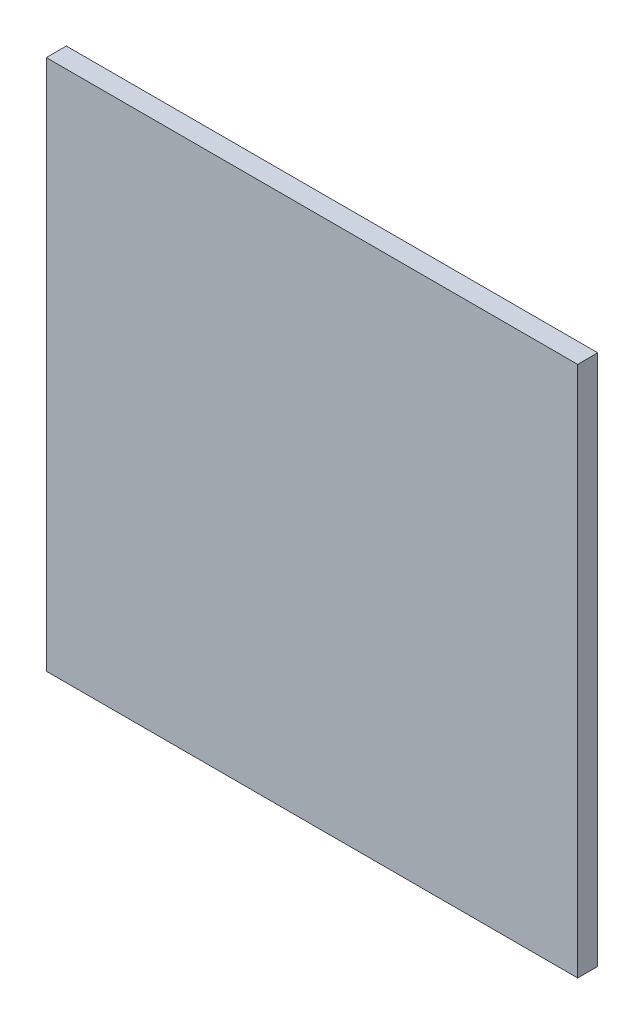
ISO-10303-21;
HEADER;
FILE_DESCRIPTION(('STEP AP214'),'2;1');
FILE_NAME('part.step','',(''),(''),'','','');
FILE_SCHEMA(('AUTOMOTIVE_DESIGN { 1 0 10303 214 1 1 1 1 }'));
ENDSEC;
DATA;
#1=APPLICATION_CONTEXT('core data for automotive mechanical design processes');
#2=APPLICATION_PROTOCOL_DEFINITION('international standard','automotive_design',2000,#1);
#3=PRODUCT_CONTEXT('',#1,'mechanical');
#4=PRODUCT('Part','Part','',(#3));
#5=PRODUCT_RELATED_PRODUCT_CATEGORY('part','',(#4));
#6=PRODUCT_DEFINITION_FORMATION('','',#4);
#7=PRODUCT_DEFINITION_CONTEXT('part definition',#1,'design');
#8=PRODUCT_DEFINITION('design','',#6,#7);
#9=PRODUCT_DEFINITION_SHAPE('','',#8);
#10=(LENGTH_UNIT() NAMED_UNIT(*) SI_UNIT(.MILLI.,.METRE.));
#11=(NAMED_UNIT(*) PLANE_ANGLE_UNIT() SI_UNIT($,.RADIAN.));
#12=(NAMED_UNIT(*) SI_UNIT($,.STERADIAN.) SOLID_ANGLE_UNIT());
#13=UNCERTAINTY_MEASURE_WITH_UNIT(LENGTH_MEASURE(1.E-05),#10,'distance_accuracy_value','');
#14=(GEOMETRIC_REPRESENTATION_CONTEXT(3) GLOBAL_UNCERTAINTY_ASSIGNED_CONTEXT((#13)) GLOBAL_UNIT_ASSIGNED_CONTEXT((#10,
#11,#12)) REPRESENTATION_CONTEXT('',''));
#15=CARTESIAN_POINT('',(0.,0.,0.));
#16=DIRECTION('',(0.,0.,1.));
#17=DIRECTION('',(1.,0.,0.));
#18=AXIS2_PLACEMENT_3D('',#15,#16,#17);
#19=CARTESIAN_POINT('',(-265.,265.,20.));
#20=DIRECTION('',(1.,0.,0.));
#21=DIRECTION('',(0.,1.,0.));
#22=AXIS2_PLACEMENT_3D('',#19,#20,#21);
#23=PLANE('',#22);
#24=DIRECTION('',(0.,-1.,0.));
#25=VECTOR('',#24,1.);
#26=CARTESIAN_POINT('',(-265.,265.,0.));
#27=LINE('',#26,#25);
#28=CARTESIAN_POINT('',(-265.,265.,0.));
#29=VERTEX_POINT('',#28);
#30=CARTESIAN_POINT('',(-265.,-265.,0.));
#31=VERTEX_POINT('',#30);
#32=EDGE_CURVE('E107',#29,#31,#27,.T.);
#33=ORIENTED_EDGE('',*,*,#32,.T.);
#34=DIRECTION('',(0.,0.,-1.));
#35=VECTOR('',#34,1.);
#36=CARTESIAN_POINT('',(-265.,-265.,20.));
#37=LINE('',#36,#35);
#38=CARTESIAN_POINT('',(-265.,-265.,20.));
#39=VERTEX_POINT('',#38);
#40=EDGE_CURVE('E11',#39,#31,#37,.T.);
#41=ORIENTED_EDGE('',*,*,#40,.F.);
#42=DIRECTION('',(0.,-1.,0.));
#43=VECTOR('',#42,1.);
#44=CARTESIAN_POINT('',(-265.,265.,20.));
#45=LINE('',#44,#43);
#46=CARTESIAN_POINT('',(-265.,265.,20.));
#47=VERTEX_POINT('',#46);
#48=EDGE_CURVE('E91',#47,#39,#45,.T.);
#49=ORIENTED_EDGE('',*,*,#48,.F.);
#50=DIRECTION('',(0.,0.,-1.));
#51=VECTOR('',#50,1.);
#52=CARTESIAN_POINT('',(-265.,265.,20.));
#53=LINE('',#52,#51);
#54=EDGE_CURVE('E103',#47,#29,#53,.T.);
#55=ORIENTED_EDGE('',*,*,#54,.T.);
#56=EDGE_LOOP('',(#33,#41,#49,#55));
#57=FACE_BOUND('',#56,.T.);
#58=ADVANCED_FACE('F39',(#57),#23,.F.);
#59=CARTESIAN_POINT('',(265.,-265.,20.));
#60=DIRECTION('',(0.,1.,0.));
#61=DIRECTION('',(-1.,0.,0.));
#62=AXIS2_PLACEMENT_3D('',#59,#60,#61);
#63=PLANE('',#62);
#64=DIRECTION('',(1.,0.,0.));
#65=VECTOR('',#64,1.);
#66=CARTESIAN_POINT('',(265.,-265.,0.));
#67=LINE('',#66,#65);
#68=CARTESIAN_POINT('',(265.,-265.,0.));
#69=VERTEX_POINT('',#68);
#70=EDGE_CURVE('E96',#31,#69,#67,.T.);
#71=ORIENTED_EDGE('',*,*,#70,.T.);
#72=DIRECTION('',(0.,0.,-1.));
#73=VECTOR('',#72,1.);
#74=CARTESIAN_POINT('',(265.,-265.,20.));
#75=LINE('',#74,#73);
#76=CARTESIAN_POINT('',(265.,-265.,20.));
#77=VERTEX_POINT('',#76);
#78=EDGE_CURVE('E48',#77,#69,#75,.T.);
#79=ORIENTED_EDGE('',*,*,#78,.F.);
#80=DIRECTION('',(1.,0.,0.));
#81=VECTOR('',#80,1.);
#82=CARTESIAN_POINT('',(265.,-265.,20.));
#83=LINE('',#82,#81);
#84=EDGE_CURVE('E86',#39,#77,#83,.T.);
#85=ORIENTED_EDGE('',*,*,#84,.F.);
#86=ORIENTED_EDGE('',*,*,#40,.T.);
#87=EDGE_LOOP('',(#71,#79,#85,#86));
#88=FACE_BOUND('',#87,.T.);
#89=ADVANCED_FACE('F95',(#88),#63,.F.);
#90=CARTESIAN_POINT('',(265.,265.,20.));
#91=DIRECTION('',(-1.,0.,0.));
#92=DIRECTION('',(0.,0.,1.));
#93=AXIS2_PLACEMENT_3D('',#90,#91,#92);
#94=PLANE('',#93);
#95=DIRECTION('',(0.,1.,0.));
#96=VECTOR('',#95,1.);
#97=CARTESIAN_POINT('',(265.,265.,0.));
#98=LINE('',#97,#96);
#99=CARTESIAN_POINT('',(265.,265.,0.));
#100=VERTEX_POINT('',#99);
#101=EDGE_CURVE('E73',#69,#100,#98,.T.);
#102=ORIENTED_EDGE('',*,*,#101,.T.);
#103=DIRECTION('',(0.,0.,-1.));
#104=VECTOR('',#103,1.);
#105=CARTESIAN_POINT('',(265.,265.,20.));
#106=LINE('',#105,#104);
#107=CARTESIAN_POINT('',(265.,265.,20.));
#108=VERTEX_POINT('',#107);
#109=EDGE_CURVE('E98',#108,#100,#106,.T.);
#110=ORIENTED_EDGE('',*,*,#109,.F.);
#111=DIRECTION('',(0.,1.,0.));
#112=VECTOR('',#111,1.);
#113=CARTESIAN_POINT('',(265.,265.,20.));
#114=LINE('',#113,#112);
#115=EDGE_CURVE('E89',#77,#108,#114,.T.);
#116=ORIENTED_EDGE('',*,*,#115,.F.);
#117=ORIENTED_EDGE('',*,*,#78,.T.);
#118=EDGE_LOOP('',(#102,#110,#116,#117));
#119=FACE_BOUND('',#118,.T.);
#120=ADVANCED_FACE('F99',(#119),#94,.F.);
#121=CARTESIAN_POINT('',(265.,265.,20.));
#122=DIRECTION('',(0.,-1.,0.));
#123=DIRECTION('',(1.,0.,0.));
#124=AXIS2_PLACEMENT_3D('',#121,#122,#123);
#125=PLANE('',#124);
#126=DIRECTION('',(-1.,0.,0.));
#127=VECTOR('',#126,1.);
#128=CARTESIAN_POINT('',(265.,265.,0.));
#129=LINE('',#128,#127);
#130=EDGE_CURVE('E79',#100,#29,#129,.T.);
#131=ORIENTED_EDGE('',*,*,#130,.T.);
#132=ORIENTED_EDGE('',*,*,#54,.F.);
#133=DIRECTION('',(-1.,0.,0.));
#134=VECTOR('',#133,1.);
#135=CARTESIAN_POINT('',(265.,265.,20.));
#136=LINE('',#135,#134);
#137=EDGE_CURVE('E56',#108,#47,#136,.T.);
#138=ORIENTED_EDGE('',*,*,#137,.F.);
#139=ORIENTED_EDGE('',*,*,#109,.T.);
#140=EDGE_LOOP('',(#131,#132,#138,#139));
#141=FACE_BOUND('',#140,.T.);
#142=ADVANCED_FACE('F120',(#141),#125,.F.);
#143=CARTESIAN_POINT('',(0.,0.,20.));
#144=DIRECTION('',(0.,0.,-1.));
#145=DIRECTION('',(-1.,0.,0.));
#146=AXIS2_PLACEMENT_3D('',#143,#144,#145);
#147=PLANE('',#146);
#148=ORIENTED_EDGE('',*,*,#48,.T.);
#149=ORIENTED_EDGE('',*,*,#84,.T.);
#150=ORIENTED_EDGE('',*,*,#115,.T.);
#151=ORIENTED_EDGE('',*,*,#137,.T.);
#152=EDGE_LOOP('',(#148,#149,#150,#151));
#153=FACE_BOUND('',#152,.T.);
#154=ADVANCED_FACE('F87',(#153),#147,.F.);
#155=CARTESIAN_POINT('',(0.,0.,0.));
#156=DIRECTION('',(0.,0.,-1.));
#157=DIRECTION('',(-1.,0.,0.));
#158=AXIS2_PLACEMENT_3D('',#155,#156,#157);
#159=PLANE('',#158);
#160=ORIENTED_EDGE('',*,*,#32,.F.);
#161=ORIENTED_EDGE('',*,*,#130,.F.);
#162=ORIENTED_EDGE('',*,*,#101,.F.);
#163=ORIENTED_EDGE('',*,*,#70,.F.);
#164=EDGE_LOOP('',(#160,#161,#162,#163));
#165=FACE_BOUND('',#164,.T.);
#166=ADVANCED_FACE('F123',(#165),#159,.T.);
#167=CLOSED_SHELL('',(#58,#89,#120,#142,#154,#166));
#168=MANIFOLD_SOLID_BREP('B2',#167);
#169=ADVANCED_BREP_SHAPE_REPRESENTATION('',(#18,#168),#14);
#170=SHAPE_DEFINITION_REPRESENTATION(#9,#169);
ENDSEC;
END-ISO-10303-21;
